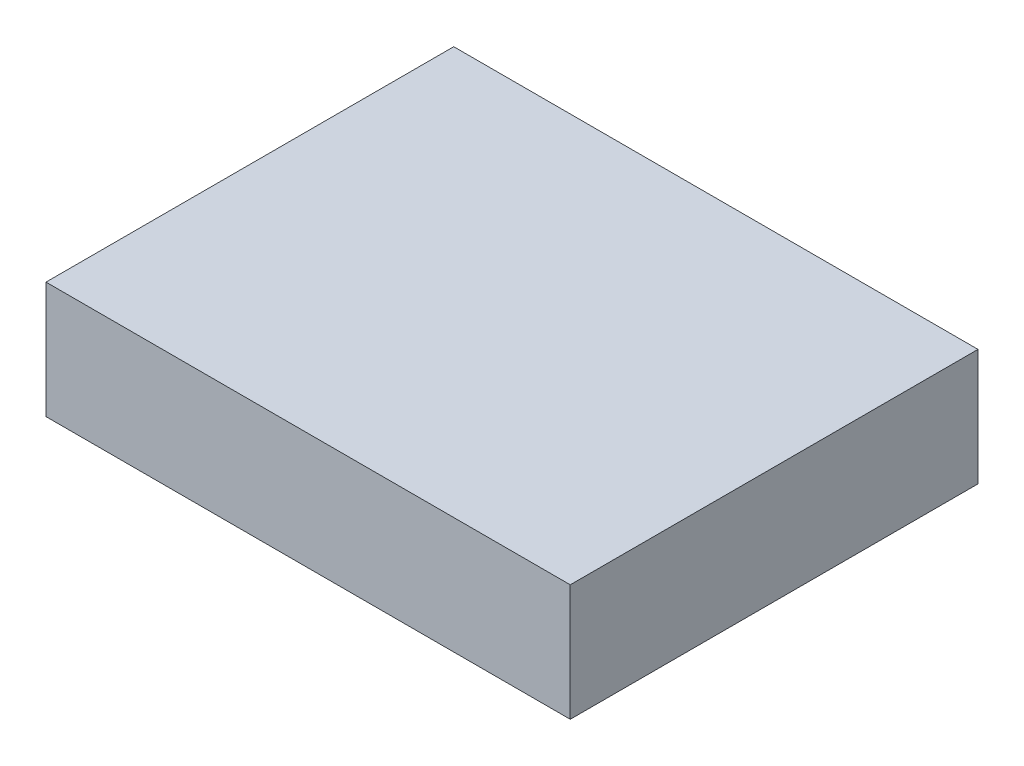
ISO-10303-21;
HEADER;
FILE_DESCRIPTION(('STEP AP214'),'2;1');
FILE_NAME('part.step','',(''),(''),'','','');
FILE_SCHEMA(('AUTOMOTIVE_DESIGN { 1 0 10303 214 1 1 1 1 }'));
ENDSEC;
DATA;
#1=APPLICATION_CONTEXT('core data for automotive mechanical design processes');
#2=APPLICATION_PROTOCOL_DEFINITION('international standard','automotive_design',2000,#1);
#3=PRODUCT_CONTEXT('',#1,'mechanical');
#4=PRODUCT('Part','Part','',(#3));
#5=PRODUCT_RELATED_PRODUCT_CATEGORY('part','',(#4));
#6=PRODUCT_DEFINITION_FORMATION('','',#4);
#7=PRODUCT_DEFINITION_CONTEXT('part definition',#1,'design');
#8=PRODUCT_DEFINITION('design','',#6,#7);
#9=PRODUCT_DEFINITION_SHAPE('','',#8);
#10=(LENGTH_UNIT() NAMED_UNIT(*) SI_UNIT(.MILLI.,.METRE.));
#11=(NAMED_UNIT(*) PLANE_ANGLE_UNIT() SI_UNIT($,.RADIAN.));
#12=(NAMED_UNIT(*) SI_UNIT($,.STERADIAN.) SOLID_ANGLE_UNIT());
#13=UNCERTAINTY_MEASURE_WITH_UNIT(LENGTH_MEASURE(1.E-05),#10,'distance_accuracy_value','');
#14=(GEOMETRIC_REPRESENTATION_CONTEXT(3) GLOBAL_UNCERTAINTY_ASSIGNED_CONTEXT((#13)) GLOBAL_UNIT_ASSIGNED_CONTEXT((#10,
#11,#12)) REPRESENTATION_CONTEXT('',''));
#15=CARTESIAN_POINT('',(0.,0.,0.));
#16=DIRECTION('',(0.,0.,1.));
#17=DIRECTION('',(1.,0.,0.));
#18=AXIS2_PLACEMENT_3D('',#15,#16,#17);
#19=CARTESIAN_POINT('',(22.86,10.16,17.78));
#20=DIRECTION('',(-1.,0.,0.));
#21=DIRECTION('',(0.,0.,1.));
#22=AXIS2_PLACEMENT_3D('',#19,#20,#21);
#23=PLANE('',#22);
#24=DIRECTION('',(0.,0.,-1.));
#25=VECTOR('',#24,1.);
#26=CARTESIAN_POINT('',(22.86,0.,17.78));
#27=LINE('',#26,#25);
#28=CARTESIAN_POINT('',(22.86,0.,17.78));
#29=VERTEX_POINT('',#28);
#30=CARTESIAN_POINT('',(22.86,0.,-17.78));
#31=VERTEX_POINT('',#30);
#32=EDGE_CURVE('E97',#29,#31,#27,.T.);
#33=ORIENTED_EDGE('',*,*,#32,.T.);
#34=DIRECTION('',(0.,-1.,0.));
#35=VECTOR('',#34,1.);
#36=CARTESIAN_POINT('',(22.86,10.16,-17.78));
#37=LINE('',#36,#35);
#38=CARTESIAN_POINT('',(22.86,10.16,-17.78));
#39=VERTEX_POINT('',#38);
#40=EDGE_CURVE('E11',#39,#31,#37,.T.);
#41=ORIENTED_EDGE('',*,*,#40,.F.);
#42=DIRECTION('',(0.,0.,-1.));
#43=VECTOR('',#42,1.);
#44=CARTESIAN_POINT('',(22.86,10.16,17.78));
#45=LINE('',#44,#43);
#46=CARTESIAN_POINT('',(22.86,10.16,17.78));
#47=VERTEX_POINT('',#46);
#48=EDGE_CURVE('E85',#47,#39,#45,.T.);
#49=ORIENTED_EDGE('',*,*,#48,.F.);
#50=DIRECTION('',(0.,-1.,0.));
#51=VECTOR('',#50,1.);
#52=CARTESIAN_POINT('',(22.86,10.16,17.78));
#53=LINE('',#52,#51);
#54=EDGE_CURVE('E93',#47,#29,#53,.T.);
#55=ORIENTED_EDGE('',*,*,#54,.T.);
#56=EDGE_LOOP('',(#33,#41,#49,#55));
#57=FACE_BOUND('',#56,.T.);
#58=ADVANCED_FACE('F34',(#57),#23,.F.);
#59=CARTESIAN_POINT('',(-22.86,10.16,-17.78));
#60=DIRECTION('',(0.,0.,1.));
#61=DIRECTION('',(1.,0.,0.));
#62=AXIS2_PLACEMENT_3D('',#59,#60,#61);
#63=PLANE('',#62);
#64=DIRECTION('',(-1.,0.,0.));
#65=VECTOR('',#64,1.);
#66=CARTESIAN_POINT('',(-22.86,0.,-17.78));
#67=LINE('',#66,#65);
#68=CARTESIAN_POINT('',(-22.86,0.,-17.78));
#69=VERTEX_POINT('',#68);
#70=EDGE_CURVE('E89',#31,#69,#67,.T.);
#71=ORIENTED_EDGE('',*,*,#70,.T.);
#72=DIRECTION('',(0.,-1.,0.));
#73=VECTOR('',#72,1.);
#74=CARTESIAN_POINT('',(-22.86,10.16,-17.78));
#75=LINE('',#74,#73);
#76=CARTESIAN_POINT('',(-22.86,10.16,-17.78));
#77=VERTEX_POINT('',#76);
#78=EDGE_CURVE('E42',#77,#69,#75,.T.);
#79=ORIENTED_EDGE('',*,*,#78,.F.);
#80=DIRECTION('',(-1.,0.,0.));
#81=VECTOR('',#80,1.);
#82=CARTESIAN_POINT('',(-22.86,10.16,-17.78));
#83=LINE('',#82,#81);
#84=EDGE_CURVE('E80',#39,#77,#83,.T.);
#85=ORIENTED_EDGE('',*,*,#84,.F.);
#86=ORIENTED_EDGE('',*,*,#40,.T.);
#87=EDGE_LOOP('',(#71,#79,#85,#86));
#88=FACE_BOUND('',#87,.T.);
#89=ADVANCED_FACE('F88',(#88),#63,.F.);
#90=CARTESIAN_POINT('',(-22.86,10.16,17.78));
#91=DIRECTION('',(1.,0.,0.));
#92=DIRECTION('',(0.,0.,-1.));
#93=AXIS2_PLACEMENT_3D('',#90,#91,#92);
#94=PLANE('',#93);
#95=DIRECTION('',(0.,0.,1.));
#96=VECTOR('',#95,1.);
#97=CARTESIAN_POINT('',(-22.86,0.,17.78));
#98=LINE('',#97,#96);
#99=CARTESIAN_POINT('',(-22.86,0.,17.78));
#100=VERTEX_POINT('',#99);
#101=EDGE_CURVE('E67',#69,#100,#98,.T.);
#102=ORIENTED_EDGE('',*,*,#101,.T.);
#103=DIRECTION('',(0.,-1.,0.));
#104=VECTOR('',#103,1.);
#105=CARTESIAN_POINT('',(-22.86,10.16,17.78));
#106=LINE('',#105,#104);
#107=CARTESIAN_POINT('',(-22.86,10.16,17.78));
#108=VERTEX_POINT('',#107);
#109=EDGE_CURVE('E90',#108,#100,#106,.T.);
#110=ORIENTED_EDGE('',*,*,#109,.F.);
#111=DIRECTION('',(0.,0.,1.));
#112=VECTOR('',#111,1.);
#113=CARTESIAN_POINT('',(-22.86,10.16,17.78));
#114=LINE('',#113,#112);
#115=EDGE_CURVE('E83',#77,#108,#114,.T.);
#116=ORIENTED_EDGE('',*,*,#115,.F.);
#117=ORIENTED_EDGE('',*,*,#78,.T.);
#118=EDGE_LOOP('',(#102,#110,#116,#117));
#119=FACE_BOUND('',#118,.T.);
#120=ADVANCED_FACE('F91',(#119),#94,.F.);
#121=CARTESIAN_POINT('',(-22.86,10.16,17.78));
#122=DIRECTION('',(0.,0.,-1.));
#123=DIRECTION('',(-1.,0.,0.));
#124=AXIS2_PLACEMENT_3D('',#121,#122,#123);
#125=PLANE('',#124);
#126=DIRECTION('',(1.,0.,0.));
#127=VECTOR('',#126,1.);
#128=CARTESIAN_POINT('',(-22.86,0.,17.78));
#129=LINE('',#128,#127);
#130=EDGE_CURVE('E73',#100,#29,#129,.T.);
#131=ORIENTED_EDGE('',*,*,#130,.T.);
#132=ORIENTED_EDGE('',*,*,#54,.F.);
#133=DIRECTION('',(1.,0.,0.));
#134=VECTOR('',#133,1.);
#135=CARTESIAN_POINT('',(-22.86,10.16,17.78));
#136=LINE('',#135,#134);
#137=EDGE_CURVE('E50',#108,#47,#136,.T.);
#138=ORIENTED_EDGE('',*,*,#137,.F.);
#139=ORIENTED_EDGE('',*,*,#109,.T.);
#140=EDGE_LOOP('',(#131,#132,#138,#139));
#141=FACE_BOUND('',#140,.T.);
#142=ADVANCED_FACE('F104',(#141),#125,.F.);
#143=CARTESIAN_POINT('',(0.,10.16,0.));
#144=DIRECTION('',(0.,-1.,0.));
#145=DIRECTION('',(0.,0.,-1.));
#146=AXIS2_PLACEMENT_3D('',#143,#144,#145);
#147=PLANE('',#146);
#148=ORIENTED_EDGE('',*,*,#48,.T.);
#149=ORIENTED_EDGE('',*,*,#84,.T.);
#150=ORIENTED_EDGE('',*,*,#115,.T.);
#151=ORIENTED_EDGE('',*,*,#137,.T.);
#152=EDGE_LOOP('',(#148,#149,#150,#151));
#153=FACE_BOUND('',#152,.T.);
#154=ADVANCED_FACE('F81',(#153),#147,.F.);
#155=CARTESIAN_POINT('',(0.,0.,0.));
#156=DIRECTION('',(0.,-1.,0.));
#157=DIRECTION('',(0.,0.,-1.));
#158=AXIS2_PLACEMENT_3D('',#155,#156,#157);
#159=PLANE('',#158);
#160=ORIENTED_EDGE('',*,*,#32,.F.);
#161=ORIENTED_EDGE('',*,*,#130,.F.);
#162=ORIENTED_EDGE('',*,*,#101,.F.);
#163=ORIENTED_EDGE('',*,*,#70,.F.);
#164=EDGE_LOOP('',(#160,#161,#162,#163));
#165=FACE_BOUND('',#164,.T.);
#166=ADVANCED_FACE('F107',(#165),#159,.T.);
#167=CLOSED_SHELL('',(#58,#89,#120,#142,#154,#166));
#168=MANIFOLD_SOLID_BREP('B2',#167);
#169=ADVANCED_BREP_SHAPE_REPRESENTATION('',(#18,#168),#14);
#170=SHAPE_DEFINITION_REPRESENTATION(#9,#169);
ENDSEC;
END-ISO-10303-21;
